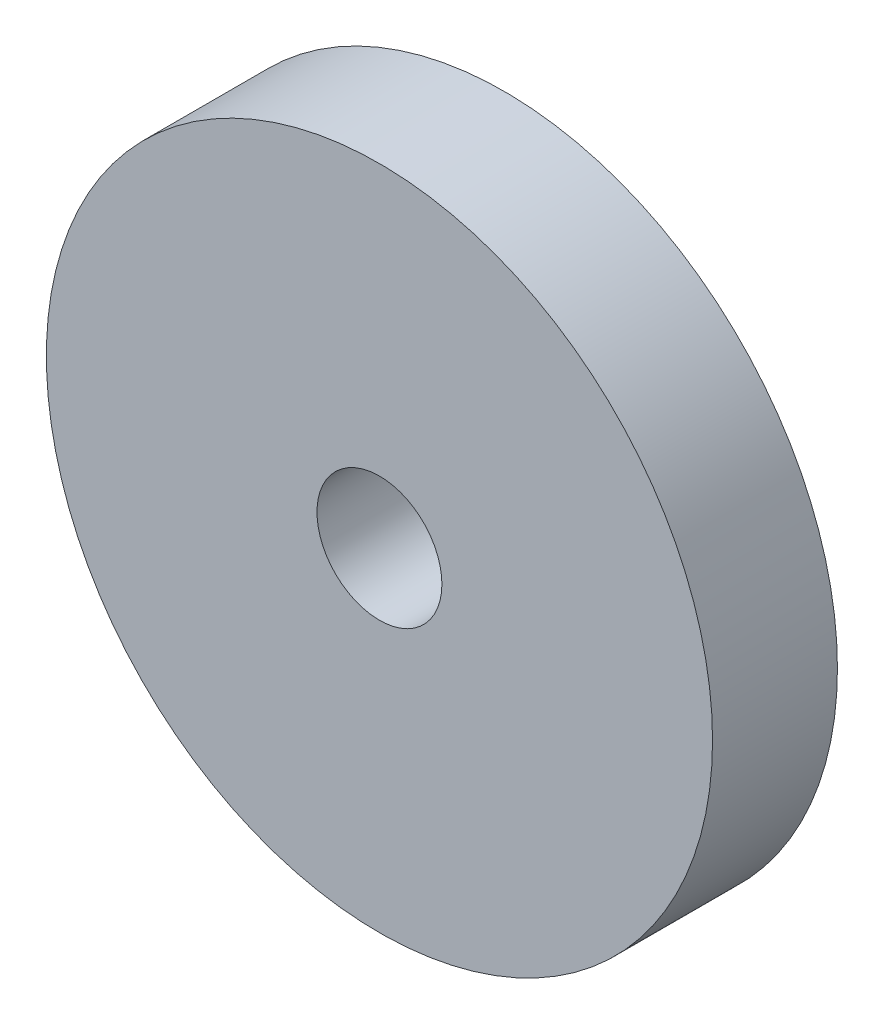
ISO-10303-21;
HEADER;
FILE_DESCRIPTION(('STEP AP214'),'2;1');
FILE_NAME('part.step','',(''),(''),'','','');
FILE_SCHEMA(('AUTOMOTIVE_DESIGN { 1 0 10303 214 1 1 1 1 }'));
ENDSEC;
DATA;
#1=APPLICATION_CONTEXT('core data for automotive mechanical design processes');
#2=APPLICATION_PROTOCOL_DEFINITION('international standard','automotive_design',2000,#1);
#3=PRODUCT_CONTEXT('',#1,'mechanical');
#4=PRODUCT('Part','Part','',(#3));
#5=PRODUCT_RELATED_PRODUCT_CATEGORY('part','',(#4));
#6=PRODUCT_DEFINITION_FORMATION('','',#4);
#7=PRODUCT_DEFINITION_CONTEXT('part definition',#1,'design');
#8=PRODUCT_DEFINITION('design','',#6,#7);
#9=PRODUCT_DEFINITION_SHAPE('','',#8);
#10=(LENGTH_UNIT() NAMED_UNIT(*) SI_UNIT(.MILLI.,.METRE.));
#11=(NAMED_UNIT(*) PLANE_ANGLE_UNIT() SI_UNIT($,.RADIAN.));
#12=(NAMED_UNIT(*) SI_UNIT($,.STERADIAN.) SOLID_ANGLE_UNIT());
#13=UNCERTAINTY_MEASURE_WITH_UNIT(LENGTH_MEASURE(1.E-05),#10,'distance_accuracy_value','');
#14=(GEOMETRIC_REPRESENTATION_CONTEXT(3) GLOBAL_UNCERTAINTY_ASSIGNED_CONTEXT((#13)) GLOBAL_UNIT_ASSIGNED_CONTEXT((#10,
#11,#12)) REPRESENTATION_CONTEXT('',''));
#15=CARTESIAN_POINT('',(0.,0.,0.));
#16=DIRECTION('',(0.,0.,1.));
#17=DIRECTION('',(1.,0.,0.));
#18=AXIS2_PLACEMENT_3D('',#15,#16,#17);
#19=CARTESIAN_POINT('',(0.,0.,19.05));
#20=DIRECTION('',(0.,0.,1.));
#21=DIRECTION('',(1.,0.,0.));
#22=AXIS2_PLACEMENT_3D('',#19,#20,#21);
#23=PLANE('',#22);
#24=CARTESIAN_POINT('',(0.,0.,19.05));
#25=DIRECTION('',(0.,0.,1.));
#26=DIRECTION('',(1.,0.,0.));
#27=AXIS2_PLACEMENT_3D('',#24,#25,#26);
#28=CIRCLE('',#27,50.8);
#29=CARTESIAN_POINT('',(50.8,0.,19.05));
#30=VERTEX_POINT('',#29);
#31=EDGE_CURVE('E10',#30,#30,#28,.T.);
#32=ORIENTED_EDGE('',*,*,#31,.T.);
#33=EDGE_LOOP('',(#32));
#34=FACE_BOUND('',#33,.T.);
#35=CARTESIAN_POINT('',(0.,0.,19.05));
#36=DIRECTION('',(0.,0.,1.));
#37=DIRECTION('',(1.,0.,0.));
#38=AXIS2_PLACEMENT_3D('',#35,#36,#37);
#39=CIRCLE('',#38,9.525);
#40=CARTESIAN_POINT('',(9.525,0.,19.05));
#41=VERTEX_POINT('',#40);
#42=EDGE_CURVE('E42',#41,#41,#39,.T.);
#43=ORIENTED_EDGE('',*,*,#42,.F.);
#44=EDGE_LOOP('',(#43));
#45=FACE_BOUND('',#44,.T.);
#46=ADVANCED_FACE('F31',(#34,#45),#23,.T.);
#47=CARTESIAN_POINT('',(0.,0.,0.));
#48=DIRECTION('',(0.,0.,1.));
#49=DIRECTION('',(1.,0.,0.));
#50=AXIS2_PLACEMENT_3D('',#47,#48,#49);
#51=PLANE('',#50);
#52=CARTESIAN_POINT('',(0.,0.,0.));
#53=DIRECTION('',(0.,0.,1.));
#54=DIRECTION('',(1.,0.,0.));
#55=AXIS2_PLACEMENT_3D('',#52,#53,#54);
#56=CIRCLE('',#55,50.8);
#57=CARTESIAN_POINT('',(50.8,0.,0.));
#58=VERTEX_POINT('',#57);
#59=EDGE_CURVE('E35',#58,#58,#56,.T.);
#60=ORIENTED_EDGE('',*,*,#59,.F.);
#61=EDGE_LOOP('',(#60));
#62=FACE_BOUND('',#61,.T.);
#63=CARTESIAN_POINT('',(0.,0.,0.));
#64=DIRECTION('',(0.,0.,1.));
#65=DIRECTION('',(1.,0.,0.));
#66=AXIS2_PLACEMENT_3D('',#63,#64,#65);
#67=CIRCLE('',#66,9.525);
#68=CARTESIAN_POINT('',(9.525,0.,0.));
#69=VERTEX_POINT('',#68);
#70=EDGE_CURVE('E44',#69,#69,#67,.T.);
#71=ORIENTED_EDGE('',*,*,#70,.T.);
#72=EDGE_LOOP('',(#71));
#73=FACE_BOUND('',#72,.T.);
#74=ADVANCED_FACE('F54',(#62,#73),#51,.F.);
#75=CARTESIAN_POINT('',(0.,0.,19.05));
#76=DIRECTION('',(0.,0.,-1.));
#77=DIRECTION('',(-1.,0.,0.));
#78=AXIS2_PLACEMENT_3D('',#75,#76,#77);
#79=CYLINDRICAL_SURFACE('',#78,50.8);
#80=ORIENTED_EDGE('',*,*,#31,.F.);
#81=EDGE_LOOP('',(#80));
#82=FACE_BOUND('',#81,.T.);
#83=ORIENTED_EDGE('',*,*,#59,.T.);
#84=EDGE_LOOP('',(#83));
#85=FACE_BOUND('',#84,.T.);
#86=ADVANCED_FACE('F33',(#82,#85),#79,.T.);
#87=CARTESIAN_POINT('',(0.,0.,19.05));
#88=DIRECTION('',(0.,0.,-1.));
#89=DIRECTION('',(-1.,0.,0.));
#90=AXIS2_PLACEMENT_3D('',#87,#88,#89);
#91=CYLINDRICAL_SURFACE('',#90,9.525);
#92=ORIENTED_EDGE('',*,*,#42,.T.);
#93=EDGE_LOOP('',(#92));
#94=FACE_BOUND('',#93,.T.);
#95=ORIENTED_EDGE('',*,*,#70,.F.);
#96=EDGE_LOOP('',(#95));
#97=FACE_BOUND('',#96,.T.);
#98=ADVANCED_FACE('F50',(#94,#97),#91,.F.);
#99=CLOSED_SHELL('',(#46,#74,#86,#98));
#100=MANIFOLD_SOLID_BREP('B2',#99);
#101=ADVANCED_BREP_SHAPE_REPRESENTATION('',(#18,#100),#14);
#102=SHAPE_DEFINITION_REPRESENTATION(#9,#101);
ENDSEC;
END-ISO-10303-21;
